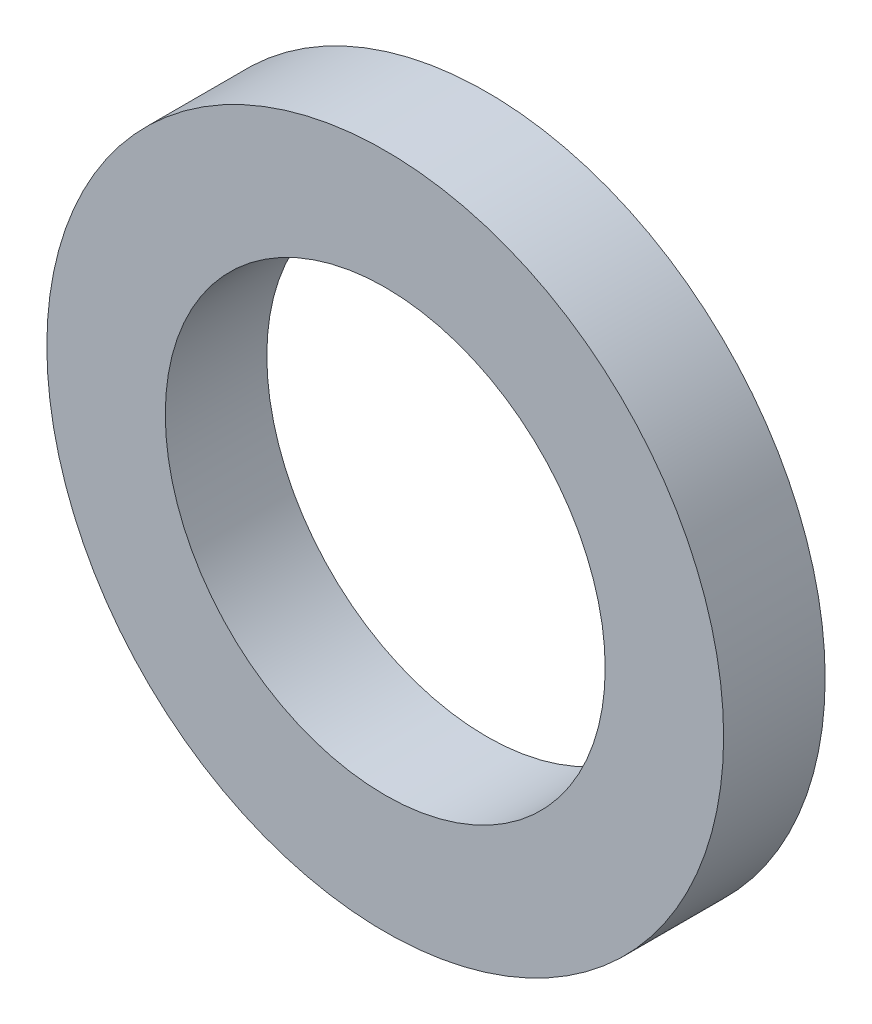
ISO-10303-21;
HEADER;
FILE_DESCRIPTION(('STEP AP214'),'2;1');
FILE_NAME('part.step','',(''),(''),'','','');
FILE_SCHEMA(('AUTOMOTIVE_DESIGN { 1 0 10303 214 1 1 1 1 }'));
ENDSEC;
DATA;
#1=APPLICATION_CONTEXT('core data for automotive mechanical design processes');
#2=APPLICATION_PROTOCOL_DEFINITION('international standard','automotive_design',2000,#1);
#3=PRODUCT_CONTEXT('',#1,'mechanical');
#4=PRODUCT('Part','Part','',(#3));
#5=PRODUCT_RELATED_PRODUCT_CATEGORY('part','',(#4));
#6=PRODUCT_DEFINITION_FORMATION('','',#4);
#7=PRODUCT_DEFINITION_CONTEXT('part definition',#1,'design');
#8=PRODUCT_DEFINITION('design','',#6,#7);
#9=PRODUCT_DEFINITION_SHAPE('','',#8);
#10=(LENGTH_UNIT() NAMED_UNIT(*) SI_UNIT(.MILLI.,.METRE.));
#11=(NAMED_UNIT(*) PLANE_ANGLE_UNIT() SI_UNIT($,.RADIAN.));
#12=(NAMED_UNIT(*) SI_UNIT($,.STERADIAN.) SOLID_ANGLE_UNIT());
#13=UNCERTAINTY_MEASURE_WITH_UNIT(LENGTH_MEASURE(1.E-05),#10,'distance_accuracy_value','');
#14=(GEOMETRIC_REPRESENTATION_CONTEXT(3) GLOBAL_UNCERTAINTY_ASSIGNED_CONTEXT((#13)) GLOBAL_UNIT_ASSIGNED_CONTEXT((#10,
#11,#12)) REPRESENTATION_CONTEXT('',''));
#15=CARTESIAN_POINT('',(0.,0.,0.));
#16=DIRECTION('',(0.,0.,1.));
#17=DIRECTION('',(1.,0.,0.));
#18=AXIS2_PLACEMENT_3D('',#15,#16,#17);
#19=CARTESIAN_POINT('',(0.,0.,3.));
#20=DIRECTION('',(0.,0.,1.));
#21=DIRECTION('',(1.,0.,0.));
#22=AXIS2_PLACEMENT_3D('',#19,#20,#21);
#23=PLANE('',#22);
#24=CARTESIAN_POINT('',(0.,0.,3.));
#25=DIRECTION('',(0.,0.,1.));
#26=DIRECTION('',(1.,0.,0.));
#27=AXIS2_PLACEMENT_3D('',#24,#25,#26);
#28=CIRCLE('',#27,10.);
#29=CARTESIAN_POINT('',(10.,0.,3.));
#30=VERTEX_POINT('',#29);
#31=EDGE_CURVE('E10',#30,#30,#28,.T.);
#32=ORIENTED_EDGE('',*,*,#31,.T.);
#33=EDGE_LOOP('',(#32));
#34=FACE_BOUND('',#33,.T.);
#35=CARTESIAN_POINT('',(0.,0.,3.));
#36=DIRECTION('',(0.,0.,1.));
#37=DIRECTION('',(1.,0.,0.));
#38=AXIS2_PLACEMENT_3D('',#35,#36,#37);
#39=CIRCLE('',#38,6.5);
#40=CARTESIAN_POINT('',(6.5,0.,3.));
#41=VERTEX_POINT('',#40);
#42=EDGE_CURVE('E44',#41,#41,#39,.T.);
#43=ORIENTED_EDGE('',*,*,#42,.F.);
#44=EDGE_LOOP('',(#43));
#45=FACE_BOUND('',#44,.T.);
#46=ADVANCED_FACE('F33',(#34,#45),#23,.T.);
#47=CARTESIAN_POINT('',(0.,0.,0.));
#48=DIRECTION('',(0.,0.,1.));
#49=DIRECTION('',(1.,0.,0.));
#50=AXIS2_PLACEMENT_3D('',#47,#48,#49);
#51=PLANE('',#50);
#52=CARTESIAN_POINT('',(0.,0.,0.));
#53=DIRECTION('',(0.,0.,1.));
#54=DIRECTION('',(1.,0.,0.));
#55=AXIS2_PLACEMENT_3D('',#52,#53,#54);
#56=CIRCLE('',#55,10.);
#57=CARTESIAN_POINT('',(10.,0.,0.));
#58=VERTEX_POINT('',#57);
#59=EDGE_CURVE('E37',#58,#58,#56,.T.);
#60=ORIENTED_EDGE('',*,*,#59,.F.);
#61=EDGE_LOOP('',(#60));
#62=FACE_BOUND('',#61,.T.);
#63=CARTESIAN_POINT('',(0.,0.,0.));
#64=DIRECTION('',(0.,0.,1.));
#65=DIRECTION('',(1.,0.,0.));
#66=AXIS2_PLACEMENT_3D('',#63,#64,#65);
#67=CIRCLE('',#66,6.5);
#68=CARTESIAN_POINT('',(6.5,0.,0.));
#69=VERTEX_POINT('',#68);
#70=EDGE_CURVE('E46',#69,#69,#67,.T.);
#71=ORIENTED_EDGE('',*,*,#70,.T.);
#72=EDGE_LOOP('',(#71));
#73=FACE_BOUND('',#72,.T.);
#74=ADVANCED_FACE('F56',(#62,#73),#51,.F.);
#75=CARTESIAN_POINT('',(0.,0.,3.));
#76=DIRECTION('',(0.,0.,-1.));
#77=DIRECTION('',(-1.,0.,0.));
#78=AXIS2_PLACEMENT_3D('',#75,#76,#77);
#79=CYLINDRICAL_SURFACE('',#78,10.);
#80=ORIENTED_EDGE('',*,*,#31,.F.);
#81=EDGE_LOOP('',(#80));
#82=FACE_BOUND('',#81,.T.);
#83=ORIENTED_EDGE('',*,*,#59,.T.);
#84=EDGE_LOOP('',(#83));
#85=FACE_BOUND('',#84,.T.);
#86=ADVANCED_FACE('F35',(#82,#85),#79,.T.);
#87=CARTESIAN_POINT('',(0.,0.,3.));
#88=DIRECTION('',(0.,0.,-1.));
#89=DIRECTION('',(-1.,0.,0.));
#90=AXIS2_PLACEMENT_3D('',#87,#88,#89);
#91=CYLINDRICAL_SURFACE('',#90,6.5);
#92=ORIENTED_EDGE('',*,*,#42,.T.);
#93=EDGE_LOOP('',(#92));
#94=FACE_BOUND('',#93,.T.);
#95=ORIENTED_EDGE('',*,*,#70,.F.);
#96=EDGE_LOOP('',(#95));
#97=FACE_BOUND('',#96,.T.);
#98=ADVANCED_FACE('F52',(#94,#97),#91,.F.);
#99=CLOSED_SHELL('',(#46,#74,#86,#98));
#100=MANIFOLD_SOLID_BREP('B2',#99);
#101=ADVANCED_BREP_SHAPE_REPRESENTATION('',(#18,#100),#14);
#102=SHAPE_DEFINITION_REPRESENTATION(#9,#101);
ENDSEC;
END-ISO-10303-21;
